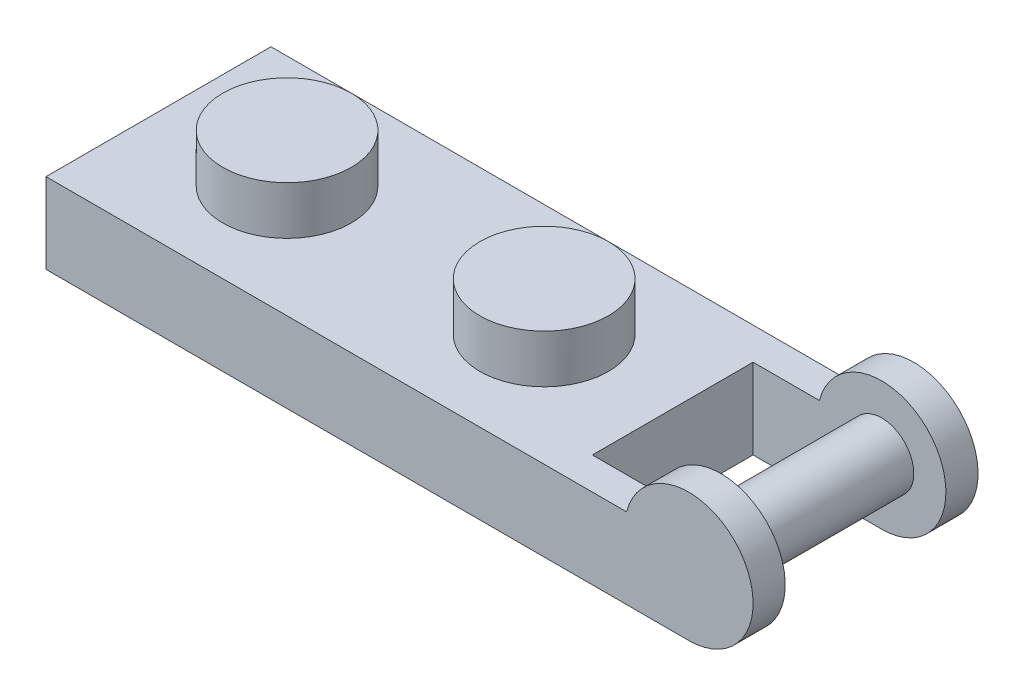
ISO-10303-21;
HEADER;
FILE_DESCRIPTION(('STEP AP214'),'2;1');
FILE_NAME('part.step','',(''),(''),'','','');
FILE_SCHEMA(('AUTOMOTIVE_DESIGN { 1 0 10303 214 1 1 1 1 }'));
ENDSEC;
DATA;
#1=APPLICATION_CONTEXT('core data for automotive mechanical design processes');
#2=APPLICATION_PROTOCOL_DEFINITION('international standard','automotive_design',2000,#1);
#3=PRODUCT_CONTEXT('',#1,'mechanical');
#4=PRODUCT('Part','Part','',(#3));
#5=PRODUCT_RELATED_PRODUCT_CATEGORY('part','',(#4));
#6=PRODUCT_DEFINITION_FORMATION('','',#4);
#7=PRODUCT_DEFINITION_CONTEXT('part definition',#1,'design');
#8=PRODUCT_DEFINITION('design','',#6,#7);
#9=PRODUCT_DEFINITION_SHAPE('','',#8);
#10=(LENGTH_UNIT() NAMED_UNIT(*) SI_UNIT(.MILLI.,.METRE.));
#11=(NAMED_UNIT(*) PLANE_ANGLE_UNIT() SI_UNIT($,.RADIAN.));
#12=(NAMED_UNIT(*) SI_UNIT($,.STERADIAN.) SOLID_ANGLE_UNIT());
#13=UNCERTAINTY_MEASURE_WITH_UNIT(LENGTH_MEASURE(1.E-05),#10,'distance_accuracy_value','');
#14=(GEOMETRIC_REPRESENTATION_CONTEXT(3) GLOBAL_UNCERTAINTY_ASSIGNED_CONTEXT((#13)) GLOBAL_UNIT_ASSIGNED_CONTEXT((#10,
#11,#12)) REPRESENTATION_CONTEXT('',''));
#15=CARTESIAN_POINT('',(0.,0.,0.));
#16=DIRECTION('',(0.,0.,1.));
#17=DIRECTION('',(1.,0.,0.));
#18=AXIS2_PLACEMENT_3D('',#15,#16,#17);
#19=CARTESIAN_POINT('',(10.16,0.,4.445));
#20=DIRECTION('',(-1.,0.,0.));
#21=DIRECTION('',(0.,0.,1.));
#22=AXIS2_PLACEMENT_3D('',#19,#20,#21);
#23=PLANE('',#22);
#24=DIRECTION('',(0.,-1.,0.));
#25=VECTOR('',#24,1.);
#26=CARTESIAN_POINT('',(10.16,-3.175,-3.175));
#27=LINE('',#26,#25);
#28=CARTESIAN_POINT('',(10.16,0.,-3.175));
#29=VERTEX_POINT('',#28);
#30=CARTESIAN_POINT('',(10.16,-3.175,-3.175));
#31=VERTEX_POINT('',#30);
#32=EDGE_CURVE('E60',#29,#31,#27,.T.);
#33=ORIENTED_EDGE('',*,*,#32,.F.);
#34=DIRECTION('',(0.,0.,-1.));
#35=VECTOR('',#34,1.);
#36=CARTESIAN_POINT('',(10.16,0.,4.445));
#37=LINE('',#36,#35);
#38=CARTESIAN_POINT('',(10.16,0.,3.175));
#39=VERTEX_POINT('',#38);
#40=EDGE_CURVE('E153',#39,#29,#37,.T.);
#41=ORIENTED_EDGE('',*,*,#40,.F.);
#42=DIRECTION('',(0.,-1.,0.));
#43=VECTOR('',#42,1.);
#44=CARTESIAN_POINT('',(10.16,-3.175,3.175));
#45=LINE('',#44,#43);
#46=CARTESIAN_POINT('',(10.16,-3.175,3.175));
#47=VERTEX_POINT('',#46);
#48=EDGE_CURVE('E167',#39,#47,#45,.T.);
#49=ORIENTED_EDGE('',*,*,#48,.T.);
#50=DIRECTION('',(0.,0.,-1.));
#51=VECTOR('',#50,1.);
#52=CARTESIAN_POINT('',(10.16,-3.175,4.445));
#53=LINE('',#52,#51);
#54=EDGE_CURVE('E55',#47,#31,#53,.T.);
#55=ORIENTED_EDGE('',*,*,#54,.T.);
#56=EDGE_LOOP('',(#33,#41,#49,#55));
#57=FACE_BOUND('',#56,.T.);
#58=ADVANCED_FACE('F38',(#57),#23,.F.);
#59=CARTESIAN_POINT('',(-10.16,-3.175,4.445));
#60=DIRECTION('',(1.,0.,0.));
#61=DIRECTION('',(0.,0.,-1.));
#62=AXIS2_PLACEMENT_3D('',#59,#60,#61);
#63=PLANE('',#62);
#64=DIRECTION('',(0.,-1.,0.));
#65=VECTOR('',#64,1.);
#66=CARTESIAN_POINT('',(-10.16,-3.175,-4.445));
#67=LINE('',#66,#65);
#68=CARTESIAN_POINT('',(-10.16,0.,-4.445));
#69=VERTEX_POINT('',#68);
#70=CARTESIAN_POINT('',(-10.16,-3.175,-4.445));
#71=VERTEX_POINT('',#70);
#72=EDGE_CURVE('E272',#69,#71,#67,.T.);
#73=ORIENTED_EDGE('',*,*,#72,.T.);
#74=DIRECTION('',(0.,0.,-1.));
#75=VECTOR('',#74,1.);
#76=CARTESIAN_POINT('',(-10.16,-3.175,4.445));
#77=LINE('',#76,#75);
#78=CARTESIAN_POINT('',(-10.16,-3.175,4.445));
#79=VERTEX_POINT('',#78);
#80=EDGE_CURVE('E300',#79,#71,#77,.T.);
#81=ORIENTED_EDGE('',*,*,#80,.F.);
#82=DIRECTION('',(0.,-1.,0.));
#83=VECTOR('',#82,1.);
#84=CARTESIAN_POINT('',(-10.16,-3.175,4.445));
#85=LINE('',#84,#83);
#86=CARTESIAN_POINT('',(-10.16,0.,4.445));
#87=VERTEX_POINT('',#86);
#88=EDGE_CURVE('E273',#87,#79,#85,.T.);
#89=ORIENTED_EDGE('',*,*,#88,.F.);
#90=DIRECTION('',(0.,0.,-1.));
#91=VECTOR('',#90,1.);
#92=CARTESIAN_POINT('',(-10.16,0.,4.445));
#93=LINE('',#92,#91);
#94=EDGE_CURVE('E284',#87,#69,#93,.T.);
#95=ORIENTED_EDGE('',*,*,#94,.T.);
#96=EDGE_LOOP('',(#73,#81,#89,#95));
#97=FACE_BOUND('',#96,.T.);
#98=ADVANCED_FACE('F40',(#97),#63,.F.);
#99=CARTESIAN_POINT('',(10.16,-3.175,4.445));
#100=DIRECTION('',(0.,1.,0.));
#101=DIRECTION('',(0.,0.,1.));
#102=AXIS2_PLACEMENT_3D('',#99,#100,#101);
#103=PLANE('',#102);
#104=DIRECTION('',(0.,0.,-1.));
#105=VECTOR('',#104,1.);
#106=CARTESIAN_POINT('',(-8.89,-3.175,2.54));
#107=LINE('',#106,#105);
#108=CARTESIAN_POINT('',(-8.89,-3.175,2.54));
#109=VERTEX_POINT('',#108);
#110=CARTESIAN_POINT('',(-8.89,-3.175,-2.54));
#111=VERTEX_POINT('',#110);
#112=EDGE_CURVE('E241',#109,#111,#107,.T.);
#113=ORIENTED_EDGE('',*,*,#112,.F.);
#114=DIRECTION('',(-1.,0.,0.));
#115=VECTOR('',#114,1.);
#116=CARTESIAN_POINT('',(8.89,-3.175,2.54));
#117=LINE('',#116,#115);
#118=CARTESIAN_POINT('',(8.89,-3.175,2.54));
#119=VERTEX_POINT('',#118);
#120=EDGE_CURVE('E209',#119,#109,#117,.T.);
#121=ORIENTED_EDGE('',*,*,#120,.F.);
#122=DIRECTION('',(0.,0.,1.));
#123=VECTOR('',#122,1.);
#124=CARTESIAN_POINT('',(8.89,-3.175,-2.54));
#125=LINE('',#124,#123);
#126=CARTESIAN_POINT('',(8.89,-3.175,-2.54));
#127=VERTEX_POINT('',#126);
#128=EDGE_CURVE('E226',#127,#119,#125,.T.);
#129=ORIENTED_EDGE('',*,*,#128,.F.);
#130=DIRECTION('',(1.,0.,0.));
#131=VECTOR('',#130,1.);
#132=CARTESIAN_POINT('',(-8.89,-3.175,-2.54));
#133=LINE('',#132,#131);
#134=EDGE_CURVE('E245',#111,#127,#133,.T.);
#135=ORIENTED_EDGE('',*,*,#134,.F.);
#136=EDGE_LOOP('',(#113,#121,#129,#135));
#137=FACE_BOUND('',#136,.T.);
#138=DIRECTION('',(1.,0.,0.));
#139=VECTOR('',#138,1.);
#140=CARTESIAN_POINT('',(10.16,-3.175,-4.445));
#141=LINE('',#140,#139);
#142=CARTESIAN_POINT('',(15.24,-3.175,-4.445));
#143=VERTEX_POINT('',#142);
#144=EDGE_CURVE('E288',#71,#143,#141,.T.);
#145=ORIENTED_EDGE('',*,*,#144,.T.);
#146=DIRECTION('',(0.,0.,-1.));
#147=VECTOR('',#146,1.);
#148=CARTESIAN_POINT('',(15.24,-3.175,-3.175));
#149=LINE('',#148,#147);
#150=CARTESIAN_POINT('',(15.24,-3.175,-3.175));
#151=VERTEX_POINT('',#150);
#152=EDGE_CURVE('E149',#151,#143,#149,.T.);
#153=ORIENTED_EDGE('',*,*,#152,.F.);
#154=DIRECTION('',(1.,0.,0.));
#155=VECTOR('',#154,1.);
#156=CARTESIAN_POINT('',(10.16,-3.175,-3.175));
#157=LINE('',#156,#155);
#158=EDGE_CURVE('E135',#31,#151,#157,.T.);
#159=ORIENTED_EDGE('',*,*,#158,.F.);
#160=ORIENTED_EDGE('',*,*,#54,.F.);
#161=DIRECTION('',(1.,0.,0.));
#162=VECTOR('',#161,1.);
#163=CARTESIAN_POINT('',(10.16,-3.175,3.175));
#164=LINE('',#163,#162);
#165=CARTESIAN_POINT('',(15.24,-3.175,3.175));
#166=VERTEX_POINT('',#165);
#167=EDGE_CURVE('E170',#47,#166,#164,.T.);
#168=ORIENTED_EDGE('',*,*,#167,.T.);
#169=DIRECTION('',(0.,0.,1.));
#170=VECTOR('',#169,1.);
#171=CARTESIAN_POINT('',(15.24,-3.175,3.175));
#172=LINE('',#171,#170);
#173=CARTESIAN_POINT('',(15.24,-3.175,4.445));
#174=VERTEX_POINT('',#173);
#175=EDGE_CURVE('E181',#166,#174,#172,.T.);
#176=ORIENTED_EDGE('',*,*,#175,.T.);
#177=DIRECTION('',(1.,0.,0.));
#178=VECTOR('',#177,1.);
#179=CARTESIAN_POINT('',(10.16,-3.175,4.445));
#180=LINE('',#179,#178);
#181=EDGE_CURVE('E277',#79,#174,#180,.T.);
#182=ORIENTED_EDGE('',*,*,#181,.F.);
#183=ORIENTED_EDGE('',*,*,#80,.T.);
#184=EDGE_LOOP('',(#145,#153,#159,#160,#168,#176,#182,#183));
#185=FACE_BOUND('',#184,.T.);
#186=ADVANCED_FACE('F339',(#137,#185),#103,.F.);
#187=CARTESIAN_POINT('',(-10.16,0.,4.445));
#188=DIRECTION('',(0.,-1.,0.));
#189=DIRECTION('',(0.,0.,-1.));
#190=AXIS2_PLACEMENT_3D('',#187,#188,#189);
#191=PLANE('',#190);
#192=CARTESIAN_POINT('',(5.08,0.,0.));
#193=DIRECTION('',(0.,-1.,0.));
#194=DIRECTION('',(0.,0.,-1.));
#195=AXIS2_PLACEMENT_3D('',#192,#193,#194);
#196=CIRCLE('',#195,2.54);
#197=CARTESIAN_POINT('',(5.08,0.,-2.54));
#198=VERTEX_POINT('',#197);
#199=EDGE_CURVE('E308',#198,#198,#196,.F.);
#200=ORIENTED_EDGE('',*,*,#199,.F.);
#201=EDGE_LOOP('',(#200));
#202=FACE_BOUND('',#201,.T.);
#203=CARTESIAN_POINT('',(-5.08,0.,0.));
#204=DIRECTION('',(0.,-1.,0.));
#205=DIRECTION('',(0.,0.,-1.));
#206=AXIS2_PLACEMENT_3D('',#203,#204,#205);
#207=CIRCLE('',#206,2.54);
#208=CARTESIAN_POINT('',(-5.08,0.,-2.54));
#209=VERTEX_POINT('',#208);
#210=EDGE_CURVE('E304',#209,#209,#207,.F.);
#211=ORIENTED_EDGE('',*,*,#210,.F.);
#212=EDGE_LOOP('',(#211));
#213=FACE_BOUND('',#212,.T.);
#214=DIRECTION('',(-1.,0.,0.));
#215=VECTOR('',#214,1.);
#216=CARTESIAN_POINT('',(-10.16,0.,-4.445));
#217=LINE('',#216,#215);
#218=CARTESIAN_POINT('',(12.7806555751583,0.,-4.445));
#219=VERTEX_POINT('',#218);
#220=EDGE_CURVE('E278',#219,#69,#217,.T.);
#221=ORIENTED_EDGE('',*,*,#220,.T.);
#222=ORIENTED_EDGE('',*,*,#94,.F.);
#223=DIRECTION('',(-1.,0.,0.));
#224=VECTOR('',#223,1.);
#225=CARTESIAN_POINT('',(-10.16,0.,4.445));
#226=LINE('',#225,#224);
#227=CARTESIAN_POINT('',(12.7806555751583,0.,4.445));
#228=VERTEX_POINT('',#227);
#229=EDGE_CURVE('E281',#228,#87,#226,.T.);
#230=ORIENTED_EDGE('',*,*,#229,.F.);
#231=DIRECTION('',(0.,0.,1.));
#232=VECTOR('',#231,1.);
#233=CARTESIAN_POINT('',(12.7806555751583,0.,3.175));
#234=LINE('',#233,#232);
#235=CARTESIAN_POINT('',(12.7806555751583,0.,3.175));
#236=VERTEX_POINT('',#235);
#237=EDGE_CURVE('E185',#236,#228,#234,.T.);
#238=ORIENTED_EDGE('',*,*,#237,.F.);
#239=DIRECTION('',(-1.,0.,0.));
#240=VECTOR('',#239,1.);
#241=CARTESIAN_POINT('',(10.16,0.,3.175));
#242=LINE('',#241,#240);
#243=EDGE_CURVE('E178',#236,#39,#242,.T.);
#244=ORIENTED_EDGE('',*,*,#243,.T.);
#245=ORIENTED_EDGE('',*,*,#40,.T.);
#246=DIRECTION('',(-1.,0.,0.));
#247=VECTOR('',#246,1.);
#248=CARTESIAN_POINT('',(10.16,0.,-3.175));
#249=LINE('',#248,#247);
#250=CARTESIAN_POINT('',(12.7806555751583,0.,-3.175));
#251=VERTEX_POINT('',#250);
#252=EDGE_CURVE('E134',#251,#29,#249,.T.);
#253=ORIENTED_EDGE('',*,*,#252,.F.);
#254=DIRECTION('',(0.,0.,-1.));
#255=VECTOR('',#254,1.);
#256=CARTESIAN_POINT('',(12.7806555751583,0.,-3.175));
#257=LINE('',#256,#255);
#258=EDGE_CURVE('E143',#251,#219,#257,.T.);
#259=ORIENTED_EDGE('',*,*,#258,.T.);
#260=EDGE_LOOP('',(#221,#222,#230,#238,#244,#245,#253,#259));
#261=FACE_BOUND('',#260,.T.);
#262=ADVANCED_FACE('F151',(#202,#213,#261),#191,.F.);
#263=CARTESIAN_POINT('',(0.,0.,4.445));
#264=DIRECTION('',(0.,0.,-1.));
#265=DIRECTION('',(-1.,0.,0.));
#266=AXIS2_PLACEMENT_3D('',#263,#264,#265);
#267=PLANE('',#266);
#268=ORIENTED_EDGE('',*,*,#88,.T.);
#269=ORIENTED_EDGE('',*,*,#181,.T.);
#270=CARTESIAN_POINT('',(15.24,-0.635,4.445));
#271=DIRECTION('',(0.,0.,1.));
#272=DIRECTION('',(1.,0.,0.));
#273=AXIS2_PLACEMENT_3D('',#270,#271,#272);
#274=CIRCLE('',#273,2.54);
#275=EDGE_CURVE('E165',#174,#228,#274,.T.);
#276=ORIENTED_EDGE('',*,*,#275,.T.);
#277=ORIENTED_EDGE('',*,*,#229,.T.);
#278=EDGE_LOOP('',(#268,#269,#276,#277));
#279=FACE_BOUND('',#278,.T.);
#280=ADVANCED_FACE('F348',(#279),#267,.F.);
#281=CARTESIAN_POINT('',(0.,0.,-4.445));
#282=DIRECTION('',(0.,0.,-1.));
#283=DIRECTION('',(-1.,0.,0.));
#284=AXIS2_PLACEMENT_3D('',#281,#282,#283);
#285=PLANE('',#284);
#286=ORIENTED_EDGE('',*,*,#72,.F.);
#287=ORIENTED_EDGE('',*,*,#220,.F.);
#288=CARTESIAN_POINT('',(15.24,-0.635,-4.445));
#289=DIRECTION('',(0.,0.,1.));
#290=DIRECTION('',(1.,0.,0.));
#291=AXIS2_PLACEMENT_3D('',#288,#289,#290);
#292=CIRCLE('',#291,2.54);
#293=EDGE_CURVE('E146',#143,#219,#292,.T.);
#294=ORIENTED_EDGE('',*,*,#293,.F.);
#295=ORIENTED_EDGE('',*,*,#144,.F.);
#296=EDGE_LOOP('',(#286,#287,#294,#295));
#297=FACE_BOUND('',#296,.T.);
#298=ADVANCED_FACE('F357',(#297),#285,.T.);
#299=CARTESIAN_POINT('',(-5.08,1.905,0.));
#300=DIRECTION('',(0.,-1.,0.));
#301=DIRECTION('',(0.,0.,-1.));
#302=AXIS2_PLACEMENT_3D('',#299,#300,#301);
#303=CYLINDRICAL_SURFACE('',#302,2.54);
#304=CARTESIAN_POINT('',(-5.08,1.905,0.));
#305=DIRECTION('',(0.,1.,0.));
#306=DIRECTION('',(0.,0.,1.));
#307=AXIS2_PLACEMENT_3D('',#304,#305,#306);
#308=CIRCLE('',#307,2.54);
#309=CARTESIAN_POINT('',(-5.08,1.905,2.54));
#310=VERTEX_POINT('',#309);
#311=EDGE_CURVE('E268',#310,#310,#308,.T.);
#312=ORIENTED_EDGE('',*,*,#311,.F.);
#313=EDGE_LOOP('',(#312));
#314=FACE_BOUND('',#313,.T.);
#315=ORIENTED_EDGE('',*,*,#210,.T.);
#316=EDGE_LOOP('',(#315));
#317=FACE_BOUND('',#316,.T.);
#318=ADVANCED_FACE('F436',(#314,#317),#303,.T.);
#319=CARTESIAN_POINT('',(-5.08,1.905,0.));
#320=DIRECTION('',(0.,1.,0.));
#321=DIRECTION('',(0.,0.,1.));
#322=AXIS2_PLACEMENT_3D('',#319,#320,#321);
#323=PLANE('',#322);
#324=ORIENTED_EDGE('',*,*,#311,.T.);
#325=EDGE_LOOP('',(#324));
#326=FACE_BOUND('',#325,.T.);
#327=ADVANCED_FACE('F432',(#326),#323,.T.);
#328=CARTESIAN_POINT('',(5.08,1.905,0.));
#329=DIRECTION('',(0.,-1.,0.));
#330=DIRECTION('',(0.,0.,-1.));
#331=AXIS2_PLACEMENT_3D('',#328,#329,#330);
#332=CYLINDRICAL_SURFACE('',#331,2.54);
#333=CARTESIAN_POINT('',(5.08,1.905,0.));
#334=DIRECTION('',(0.,1.,0.));
#335=DIRECTION('',(0.,0.,1.));
#336=AXIS2_PLACEMENT_3D('',#333,#334,#335);
#337=CIRCLE('',#336,2.54);
#338=CARTESIAN_POINT('',(5.08,1.905,2.54));
#339=VERTEX_POINT('',#338);
#340=EDGE_CURVE('E255',#339,#339,#337,.T.);
#341=ORIENTED_EDGE('',*,*,#340,.F.);
#342=EDGE_LOOP('',(#341));
#343=FACE_BOUND('',#342,.T.);
#344=ORIENTED_EDGE('',*,*,#199,.T.);
#345=EDGE_LOOP('',(#344));
#346=FACE_BOUND('',#345,.T.);
#347=ADVANCED_FACE('F428',(#343,#346),#332,.T.);
#348=CARTESIAN_POINT('',(5.08,1.905,0.));
#349=DIRECTION('',(0.,1.,0.));
#350=DIRECTION('',(0.,0.,1.));
#351=AXIS2_PLACEMENT_3D('',#348,#349,#350);
#352=PLANE('',#351);
#353=ORIENTED_EDGE('',*,*,#340,.T.);
#354=EDGE_LOOP('',(#353));
#355=FACE_BOUND('',#354,.T.);
#356=ADVANCED_FACE('F424',(#355),#352,.T.);
#357=CARTESIAN_POINT('',(8.89,-1.27,2.54));
#358=DIRECTION('',(0.,0.,1.));
#359=DIRECTION('',(1.,0.,0.));
#360=AXIS2_PLACEMENT_3D('',#357,#358,#359);
#361=PLANE('',#360);
#362=ORIENTED_EDGE('',*,*,#120,.T.);
#363=DIRECTION('',(0.,-1.,0.));
#364=VECTOR('',#363,1.);
#365=CARTESIAN_POINT('',(-8.89,-1.27,2.54));
#366=LINE('',#365,#364);
#367=CARTESIAN_POINT('',(-8.89,-1.27,2.54));
#368=VERTEX_POINT('',#367);
#369=EDGE_CURVE('E238',#368,#109,#366,.T.);
#370=ORIENTED_EDGE('',*,*,#369,.F.);
#371=DIRECTION('',(-1.,0.,0.));
#372=VECTOR('',#371,1.);
#373=CARTESIAN_POINT('',(8.89,-1.27,2.54));
#374=LINE('',#373,#372);
#375=CARTESIAN_POINT('',(8.89,-1.27,2.54));
#376=VERTEX_POINT('',#375);
#377=EDGE_CURVE('E221',#376,#368,#374,.T.);
#378=ORIENTED_EDGE('',*,*,#377,.F.);
#379=DIRECTION('',(0.,-1.,0.));
#380=VECTOR('',#379,1.);
#381=CARTESIAN_POINT('',(8.89,-1.27,2.54));
#382=LINE('',#381,#380);
#383=EDGE_CURVE('E252',#376,#119,#382,.T.);
#384=ORIENTED_EDGE('',*,*,#383,.T.);
#385=EDGE_LOOP('',(#362,#370,#378,#384));
#386=FACE_BOUND('',#385,.T.);
#387=ADVANCED_FACE('F414',(#386),#361,.F.);
#388=CARTESIAN_POINT('',(8.89,-1.27,-2.54));
#389=DIRECTION('',(1.,0.,0.));
#390=DIRECTION('',(0.,0.,-1.));
#391=AXIS2_PLACEMENT_3D('',#388,#389,#390);
#392=PLANE('',#391);
#393=ORIENTED_EDGE('',*,*,#128,.T.);
#394=ORIENTED_EDGE('',*,*,#383,.F.);
#395=DIRECTION('',(0.,0.,1.));
#396=VECTOR('',#395,1.);
#397=CARTESIAN_POINT('',(8.89,-1.27,-2.54));
#398=LINE('',#397,#396);
#399=CARTESIAN_POINT('',(8.89,-1.27,-2.54));
#400=VERTEX_POINT('',#399);
#401=EDGE_CURVE('E234',#400,#376,#398,.T.);
#402=ORIENTED_EDGE('',*,*,#401,.F.);
#403=DIRECTION('',(0.,-1.,0.));
#404=VECTOR('',#403,1.);
#405=CARTESIAN_POINT('',(8.89,-1.27,-2.54));
#406=LINE('',#405,#404);
#407=EDGE_CURVE('E256',#400,#127,#406,.T.);
#408=ORIENTED_EDGE('',*,*,#407,.T.);
#409=EDGE_LOOP('',(#393,#394,#402,#408));
#410=FACE_BOUND('',#409,.T.);
#411=ADVANCED_FACE('F410',(#410),#392,.F.);
#412=CARTESIAN_POINT('',(-8.89,-1.27,-2.54));
#413=DIRECTION('',(0.,0.,-1.));
#414=DIRECTION('',(-1.,0.,0.));
#415=AXIS2_PLACEMENT_3D('',#412,#413,#414);
#416=PLANE('',#415);
#417=ORIENTED_EDGE('',*,*,#134,.T.);
#418=ORIENTED_EDGE('',*,*,#407,.F.);
#419=DIRECTION('',(1.,0.,0.));
#420=VECTOR('',#419,1.);
#421=CARTESIAN_POINT('',(-8.89,-1.27,-2.54));
#422=LINE('',#421,#420);
#423=CARTESIAN_POINT('',(-8.89,-1.27,-2.54));
#424=VERTEX_POINT('',#423);
#425=EDGE_CURVE('E230',#424,#400,#422,.T.);
#426=ORIENTED_EDGE('',*,*,#425,.F.);
#427=DIRECTION('',(0.,-1.,0.));
#428=VECTOR('',#427,1.);
#429=CARTESIAN_POINT('',(-8.89,-1.27,-2.54));
#430=LINE('',#429,#428);
#431=EDGE_CURVE('E259',#424,#111,#430,.T.);
#432=ORIENTED_EDGE('',*,*,#431,.T.);
#433=EDGE_LOOP('',(#417,#418,#426,#432));
#434=FACE_BOUND('',#433,.T.);
#435=ADVANCED_FACE('F413',(#434),#416,.F.);
#436=CARTESIAN_POINT('',(-8.89,-1.27,2.54));
#437=DIRECTION('',(-1.,0.,0.));
#438=DIRECTION('',(0.,0.,1.));
#439=AXIS2_PLACEMENT_3D('',#436,#437,#438);
#440=PLANE('',#439);
#441=ORIENTED_EDGE('',*,*,#112,.T.);
#442=ORIENTED_EDGE('',*,*,#431,.F.);
#443=DIRECTION('',(0.,0.,-1.));
#444=VECTOR('',#443,1.);
#445=CARTESIAN_POINT('',(-8.89,-1.27,2.54));
#446=LINE('',#445,#444);
#447=EDGE_CURVE('E225',#368,#424,#446,.T.);
#448=ORIENTED_EDGE('',*,*,#447,.F.);
#449=ORIENTED_EDGE('',*,*,#369,.T.);
#450=EDGE_LOOP('',(#441,#442,#448,#449));
#451=FACE_BOUND('',#450,.T.);
#452=ADVANCED_FACE('F408',(#451),#440,.F.);
#453=CARTESIAN_POINT('',(0.,-1.27,0.));
#454=DIRECTION('',(0.,-1.,0.));
#455=DIRECTION('',(0.,0.,-1.));
#456=AXIS2_PLACEMENT_3D('',#453,#454,#455);
#457=PLANE('',#456);
#458=CARTESIAN_POINT('',(0.,-1.27,0.));
#459=DIRECTION('',(0.,-1.,0.));
#460=DIRECTION('',(0.,0.,-1.));
#461=AXIS2_PLACEMENT_3D('',#458,#459,#460);
#462=CIRCLE('',#461,1.905);
#463=CARTESIAN_POINT('',(0.,-1.27,-1.905));
#464=VERTEX_POINT('',#463);
#465=EDGE_CURVE('E193',#464,#464,#462,.T.);
#466=ORIENTED_EDGE('',*,*,#465,.F.);
#467=EDGE_LOOP('',(#466));
#468=FACE_BOUND('',#467,.T.);
#469=CARTESIAN_POINT('',(-5.08,-1.27,0.));
#470=DIRECTION('',(0.,-1.,0.));
#471=DIRECTION('',(0.,0.,-1.));
#472=AXIS2_PLACEMENT_3D('',#469,#470,#471);
#473=CIRCLE('',#472,1.905);
#474=CARTESIAN_POINT('',(-5.08,-1.27,-1.905));
#475=VERTEX_POINT('',#474);
#476=EDGE_CURVE('E210',#475,#475,#473,.T.);
#477=ORIENTED_EDGE('',*,*,#476,.F.);
#478=EDGE_LOOP('',(#477));
#479=FACE_BOUND('',#478,.T.);
#480=CARTESIAN_POINT('',(5.08,-1.27,0.));
#481=DIRECTION('',(0.,-1.,0.));
#482=DIRECTION('',(0.,0.,-1.));
#483=AXIS2_PLACEMENT_3D('',#480,#481,#482);
#484=CIRCLE('',#483,1.905);
#485=CARTESIAN_POINT('',(5.08,-1.27,-1.905));
#486=VERTEX_POINT('',#485);
#487=EDGE_CURVE('E204',#486,#486,#484,.T.);
#488=ORIENTED_EDGE('',*,*,#487,.F.);
#489=EDGE_LOOP('',(#488));
#490=FACE_BOUND('',#489,.T.);
#491=ORIENTED_EDGE('',*,*,#377,.T.);
#492=ORIENTED_EDGE('',*,*,#447,.T.);
#493=ORIENTED_EDGE('',*,*,#425,.T.);
#494=ORIENTED_EDGE('',*,*,#401,.T.);
#495=EDGE_LOOP('',(#491,#492,#493,#494));
#496=FACE_BOUND('',#495,.T.);
#497=ADVANCED_FACE('F404',(#468,#479,#490,#496),#457,.T.);
#498=CARTESIAN_POINT('',(5.08,1.27,0.));
#499=DIRECTION('',(0.,-1.,0.));
#500=DIRECTION('',(0.,0.,-1.));
#501=AXIS2_PLACEMENT_3D('',#498,#499,#500);
#502=CYLINDRICAL_SURFACE('',#501,1.905);
#503=CARTESIAN_POINT('',(5.08,1.27,0.));
#504=DIRECTION('',(0.,-1.,0.));
#505=DIRECTION('',(0.,0.,-1.));
#506=AXIS2_PLACEMENT_3D('',#503,#504,#505);
#507=CIRCLE('',#506,1.905);
#508=CARTESIAN_POINT('',(5.08,1.27,-1.905));
#509=VERTEX_POINT('',#508);
#510=EDGE_CURVE('E214',#509,#509,#507,.T.);
#511=ORIENTED_EDGE('',*,*,#510,.F.);
#512=EDGE_LOOP('',(#511));
#513=FACE_BOUND('',#512,.T.);
#514=ORIENTED_EDGE('',*,*,#487,.T.);
#515=EDGE_LOOP('',(#514));
#516=FACE_BOUND('',#515,.T.);
#517=ADVANCED_FACE('F400',(#513,#516),#502,.F.);
#518=CARTESIAN_POINT('',(5.08,1.27,0.));
#519=DIRECTION('',(0.,-1.,0.));
#520=DIRECTION('',(0.,0.,-1.));
#521=AXIS2_PLACEMENT_3D('',#518,#519,#520);
#522=PLANE('',#521);
#523=ORIENTED_EDGE('',*,*,#510,.T.);
#524=EDGE_LOOP('',(#523));
#525=FACE_BOUND('',#524,.T.);
#526=ADVANCED_FACE('F396',(#525),#522,.T.);
#527=CARTESIAN_POINT('',(-5.08,1.27,0.));
#528=DIRECTION('',(0.,-1.,0.));
#529=DIRECTION('',(0.,0.,-1.));
#530=AXIS2_PLACEMENT_3D('',#527,#528,#529);
#531=CYLINDRICAL_SURFACE('',#530,1.905);
#532=CARTESIAN_POINT('',(-5.08,1.27,0.));
#533=DIRECTION('',(0.,-1.,0.));
#534=DIRECTION('',(0.,0.,-1.));
#535=AXIS2_PLACEMENT_3D('',#532,#533,#534);
#536=CIRCLE('',#535,1.905);
#537=CARTESIAN_POINT('',(-5.08,1.27,-1.905));
#538=VERTEX_POINT('',#537);
#539=EDGE_CURVE('E205',#538,#538,#536,.T.);
#540=ORIENTED_EDGE('',*,*,#539,.F.);
#541=EDGE_LOOP('',(#540));
#542=FACE_BOUND('',#541,.T.);
#543=ORIENTED_EDGE('',*,*,#476,.T.);
#544=EDGE_LOOP('',(#543));
#545=FACE_BOUND('',#544,.T.);
#546=ADVANCED_FACE('F392',(#542,#545),#531,.F.);
#547=CARTESIAN_POINT('',(-5.08,1.27,0.));
#548=DIRECTION('',(0.,-1.,0.));
#549=DIRECTION('',(0.,0.,-1.));
#550=AXIS2_PLACEMENT_3D('',#547,#548,#549);
#551=PLANE('',#550);
#552=ORIENTED_EDGE('',*,*,#539,.T.);
#553=EDGE_LOOP('',(#552));
#554=FACE_BOUND('',#553,.T.);
#555=ADVANCED_FACE('F381',(#554),#551,.T.);
#556=CARTESIAN_POINT('',(0.,-8.56315367264149,0.));
#557=DIRECTION('',(0.,1.,0.));
#558=DIRECTION('',(0.,0.,1.));
#559=AXIS2_PLACEMENT_3D('',#556,#557,#558);
#560=CYLINDRICAL_SURFACE('',#559,1.905);
#561=CARTESIAN_POINT('',(0.,-3.175,0.));
#562=DIRECTION('',(0.,1.,0.));
#563=DIRECTION('',(0.,0.,1.));
#564=AXIS2_PLACEMENT_3D('',#561,#562,#563);
#565=CIRCLE('',#564,1.905);
#566=CARTESIAN_POINT('',(0.,-3.175,1.905));
#567=VERTEX_POINT('',#566);
#568=EDGE_CURVE('E189',#567,#567,#565,.T.);
#569=ORIENTED_EDGE('',*,*,#568,.T.);
#570=EDGE_LOOP('',(#569));
#571=FACE_BOUND('',#570,.T.);
#572=ORIENTED_EDGE('',*,*,#465,.T.);
#573=EDGE_LOOP('',(#572));
#574=FACE_BOUND('',#573,.T.);
#575=ADVANCED_FACE('F377',(#571,#574),#560,.T.);
#576=CARTESIAN_POINT('',(0.,-8.56315367264149,0.));
#577=DIRECTION('',(0.,1.,0.));
#578=DIRECTION('',(0.,0.,1.));
#579=AXIS2_PLACEMENT_3D('',#576,#577,#578);
#580=CYLINDRICAL_SURFACE('',#579,0.9525);
#581=CARTESIAN_POINT('',(0.,-3.175,0.));
#582=DIRECTION('',(0.,1.,0.));
#583=DIRECTION('',(0.,0.,1.));
#584=AXIS2_PLACEMENT_3D('',#581,#582,#583);
#585=CIRCLE('',#584,0.9525);
#586=CARTESIAN_POINT('',(0.,-3.175,0.9525));
#587=VERTEX_POINT('',#586);
#588=EDGE_CURVE('E197',#587,#587,#585,.T.);
#589=ORIENTED_EDGE('',*,*,#588,.F.);
#590=EDGE_LOOP('',(#589));
#591=FACE_BOUND('',#590,.T.);
#592=CARTESIAN_POINT('',(0.,-1.27,0.));
#593=DIRECTION('',(0.,-1.,0.));
#594=DIRECTION('',(0.,0.,-1.));
#595=AXIS2_PLACEMENT_3D('',#592,#593,#594);
#596=CIRCLE('',#595,0.9525);
#597=CARTESIAN_POINT('',(0.,-1.27,-0.9525));
#598=VERTEX_POINT('',#597);
#599=EDGE_CURVE('E311',#598,#598,#596,.F.);
#600=ORIENTED_EDGE('',*,*,#599,.T.);
#601=EDGE_LOOP('',(#600));
#602=FACE_BOUND('',#601,.T.);
#603=ADVANCED_FACE('F380',(#591,#602),#580,.F.);
#604=CARTESIAN_POINT('',(10.16,-3.175,4.445));
#605=DIRECTION('',(0.,1.,0.));
#606=DIRECTION('',(0.,0.,1.));
#607=AXIS2_PLACEMENT_3D('',#604,#605,#606);
#608=PLANE('',#607);
#609=ORIENTED_EDGE('',*,*,#588,.T.);
#610=EDGE_LOOP('',(#609));
#611=FACE_BOUND('',#610,.T.);
#612=ORIENTED_EDGE('',*,*,#568,.F.);
#613=EDGE_LOOP('',(#612));
#614=FACE_BOUND('',#613,.T.);
#615=ADVANCED_FACE('F385',(#611,#614),#608,.F.);
#616=ORIENTED_EDGE('',*,*,#599,.F.);
#617=EDGE_LOOP('',(#616));
#618=FACE_BOUND('',#617,.T.);
#619=ADVANCED_FACE('F373',(#618),#457,.T.);
#620=CARTESIAN_POINT('',(15.24,-0.635,3.175));
#621=DIRECTION('',(0.,0.,1.));
#622=DIRECTION('',(1.,0.,0.));
#623=AXIS2_PLACEMENT_3D('',#620,#621,#622);
#624=CYLINDRICAL_SURFACE('',#623,2.54);
#625=ORIENTED_EDGE('',*,*,#275,.F.);
#626=ORIENTED_EDGE('',*,*,#175,.F.);
#627=CARTESIAN_POINT('',(15.24,-0.635,3.175));
#628=DIRECTION('',(0.,0.,1.));
#629=DIRECTION('',(1.,0.,0.));
#630=AXIS2_PLACEMENT_3D('',#627,#628,#629);
#631=CIRCLE('',#630,2.54);
#632=EDGE_CURVE('E174',#166,#236,#631,.T.);
#633=ORIENTED_EDGE('',*,*,#632,.T.);
#634=ORIENTED_EDGE('',*,*,#237,.T.);
#635=EDGE_LOOP('',(#625,#626,#633,#634));
#636=FACE_BOUND('',#635,.T.);
#637=ADVANCED_FACE('F363',(#636),#624,.T.);
#638=CARTESIAN_POINT('',(15.24,-0.635,3.175));
#639=DIRECTION('',(0.,0.,1.));
#640=DIRECTION('',(1.,0.,0.));
#641=AXIS2_PLACEMENT_3D('',#638,#639,#640);
#642=PLANE('',#641);
#643=CARTESIAN_POINT('',(15.24,-0.635,3.175));
#644=DIRECTION('',(0.,0.,1.));
#645=DIRECTION('',(1.,0.,0.));
#646=AXIS2_PLACEMENT_3D('',#643,#644,#645);
#647=CIRCLE('',#646,1.27);
#648=CARTESIAN_POINT('',(16.51,-0.635,3.175));
#649=VERTEX_POINT('',#648);
#650=EDGE_CURVE('E11',#649,#649,#647,.F.);
#651=ORIENTED_EDGE('',*,*,#650,.F.);
#652=EDGE_LOOP('',(#651));
#653=FACE_BOUND('',#652,.T.);
#654=ORIENTED_EDGE('',*,*,#48,.F.);
#655=ORIENTED_EDGE('',*,*,#243,.F.);
#656=ORIENTED_EDGE('',*,*,#632,.F.);
#657=ORIENTED_EDGE('',*,*,#167,.F.);
#658=EDGE_LOOP('',(#654,#655,#656,#657));
#659=FACE_BOUND('',#658,.T.);
#660=ADVANCED_FACE('F332',(#653,#659),#642,.F.);
#661=CARTESIAN_POINT('',(15.24,-0.635,-3.175));
#662=DIRECTION('',(0.,0.,-1.));
#663=DIRECTION('',(-1.,0.,0.));
#664=AXIS2_PLACEMENT_3D('',#661,#662,#663);
#665=CYLINDRICAL_SURFACE('',#664,2.54);
#666=ORIENTED_EDGE('',*,*,#293,.T.);
#667=ORIENTED_EDGE('',*,*,#258,.F.);
#668=CARTESIAN_POINT('',(15.24,-0.635,-3.175));
#669=DIRECTION('',(0.,0.,1.));
#670=DIRECTION('',(1.,0.,0.));
#671=AXIS2_PLACEMENT_3D('',#668,#669,#670);
#672=CIRCLE('',#671,2.54);
#673=EDGE_CURVE('E130',#151,#251,#672,.T.);
#674=ORIENTED_EDGE('',*,*,#673,.F.);
#675=ORIENTED_EDGE('',*,*,#152,.T.);
#676=EDGE_LOOP('',(#666,#667,#674,#675));
#677=FACE_BOUND('',#676,.T.);
#678=ADVANCED_FACE('F144',(#677),#665,.T.);
#679=CARTESIAN_POINT('',(15.24,-0.635,-3.175));
#680=DIRECTION('',(0.,0.,-1.));
#681=DIRECTION('',(1.,0.,0.));
#682=AXIS2_PLACEMENT_3D('',#679,#680,#681);
#683=PLANE('',#682);
#684=CARTESIAN_POINT('',(15.24,-0.635,-3.175));
#685=DIRECTION('',(0.,0.,-1.));
#686=DIRECTION('',(-1.,0.,0.));
#687=AXIS2_PLACEMENT_3D('',#684,#685,#686);
#688=CIRCLE('',#687,1.27);
#689=CARTESIAN_POINT('',(13.97,-0.635,-3.175));
#690=VERTEX_POINT('',#689);
#691=EDGE_CURVE('E42',#690,#690,#688,.F.);
#692=ORIENTED_EDGE('',*,*,#691,.F.);
#693=EDGE_LOOP('',(#692));
#694=FACE_BOUND('',#693,.T.);
#695=ORIENTED_EDGE('',*,*,#32,.T.);
#696=ORIENTED_EDGE('',*,*,#158,.T.);
#697=ORIENTED_EDGE('',*,*,#673,.T.);
#698=ORIENTED_EDGE('',*,*,#252,.T.);
#699=EDGE_LOOP('',(#695,#696,#697,#698));
#700=FACE_BOUND('',#699,.T.);
#701=ADVANCED_FACE('F132',(#694,#700),#683,.F.);
#702=CARTESIAN_POINT('',(15.24,-0.635,4.445));
#703=DIRECTION('',(0.,0.,-1.));
#704=DIRECTION('',(-1.,0.,0.));
#705=AXIS2_PLACEMENT_3D('',#702,#703,#704);
#706=CYLINDRICAL_SURFACE('',#705,1.27);
#707=ORIENTED_EDGE('',*,*,#691,.T.);
#708=EDGE_LOOP('',(#707));
#709=FACE_BOUND('',#708,.T.);
#710=ORIENTED_EDGE('',*,*,#650,.T.);
#711=EDGE_LOOP('',(#710));
#712=FACE_BOUND('',#711,.T.);
#713=ADVANCED_FACE('F322',(#709,#712),#706,.T.);
#714=CLOSED_SHELL('',(#58,#98,#186,#262,#280,#298,#318,#327,#347,#356,#387,#411,#435,#452,#497,
#517,#526,#546,#555,#575,#603,#615,#619,#637,#660,#678,#701,#713));
#715=MANIFOLD_SOLID_BREP('B2',#714);
#716=ADVANCED_BREP_SHAPE_REPRESENTATION('',(#18,#715),#14);
#717=SHAPE_DEFINITION_REPRESENTATION(#9,#716);
ENDSEC;
END-ISO-10303-21;
